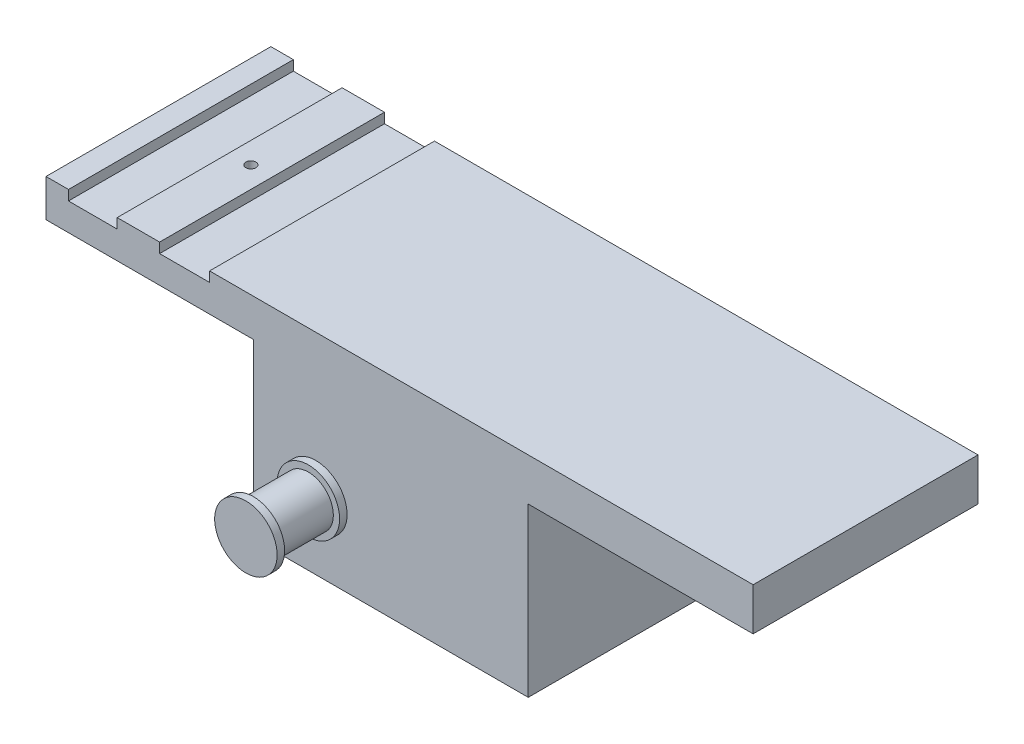
ISO-10303-21;
HEADER;
FILE_DESCRIPTION(('STEP AP214'),'2;1');
FILE_NAME('part.step','',(''),(''),'','','');
FILE_SCHEMA(('AUTOMOTIVE_DESIGN { 1 0 10303 214 1 1 1 1 }'));
ENDSEC;
DATA;
#1=APPLICATION_CONTEXT('core data for automotive mechanical design processes');
#2=APPLICATION_PROTOCOL_DEFINITION('international standard','automotive_design',2000,#1);
#3=PRODUCT_CONTEXT('',#1,'mechanical');
#4=PRODUCT('Part','Part','',(#3));
#5=PRODUCT_RELATED_PRODUCT_CATEGORY('part','',(#4));
#6=PRODUCT_DEFINITION_FORMATION('','',#4);
#7=PRODUCT_DEFINITION_CONTEXT('part definition',#1,'design');
#8=PRODUCT_DEFINITION('design','',#6,#7);
#9=PRODUCT_DEFINITION_SHAPE('','',#8);
#10=(LENGTH_UNIT() NAMED_UNIT(*) SI_UNIT(.MILLI.,.METRE.));
#11=(NAMED_UNIT(*) PLANE_ANGLE_UNIT() SI_UNIT($,.RADIAN.));
#12=(NAMED_UNIT(*) SI_UNIT($,.STERADIAN.) SOLID_ANGLE_UNIT());
#13=UNCERTAINTY_MEASURE_WITH_UNIT(LENGTH_MEASURE(1.E-05),#10,'distance_accuracy_value','');
#14=(GEOMETRIC_REPRESENTATION_CONTEXT(3) GLOBAL_UNCERTAINTY_ASSIGNED_CONTEXT((#13)) GLOBAL_UNIT_ASSIGNED_CONTEXT((#10,
#11,#12)) REPRESENTATION_CONTEXT('',''));
#15=CARTESIAN_POINT('',(0.,0.,0.));
#16=DIRECTION('',(0.,0.,1.));
#17=DIRECTION('',(1.,0.,0.));
#18=AXIS2_PLACEMENT_3D('',#15,#16,#17);
#19=CARTESIAN_POINT('',(-175.,-41.9467957222246,2.));
#20=DIRECTION('',(0.,0.,-1.));
#21=DIRECTION('',(-1.,0.,0.));
#22=AXIS2_PLACEMENT_3D('',#19,#20,#21);
#23=CYLINDRICAL_SURFACE('',#22,10.);
#24=CARTESIAN_POINT('',(-175.,-41.9467957222246,0.));
#25=DIRECTION('',(0.,0.,1.));
#26=DIRECTION('',(1.,0.,0.));
#27=AXIS2_PLACEMENT_3D('',#24,#25,#26);
#28=CIRCLE('',#27,10.);
#29=CARTESIAN_POINT('',(-165.,-41.9467957222246,0.));
#30=VERTEX_POINT('',#29);
#31=EDGE_CURVE('E365',#30,#30,#28,.F.);
#32=ORIENTED_EDGE('',*,*,#31,.T.);
#33=EDGE_LOOP('',(#32));
#34=FACE_BOUND('',#33,.T.);
#35=CARTESIAN_POINT('',(-175.,-41.9467957222246,-1.));
#36=DIRECTION('',(0.,0.,-1.));
#37=DIRECTION('',(-1.,0.,0.));
#38=AXIS2_PLACEMENT_3D('',#35,#36,#37);
#39=CIRCLE('',#38,10.);
#40=CARTESIAN_POINT('',(-185.,-41.9467957222246,-1.));
#41=VERTEX_POINT('',#40);
#42=EDGE_CURVE('E11',#41,#41,#39,.T.);
#43=ORIENTED_EDGE('',*,*,#42,.F.);
#44=EDGE_LOOP('',(#43));
#45=FACE_BOUND('',#44,.T.);
#46=ADVANCED_FACE('F38',(#34,#45),#23,.T.);
#47=CARTESIAN_POINT('',(0.,0.,90.));
#48=DIRECTION('',(-1.,0.,0.));
#49=DIRECTION('',(0.,0.,1.));
#50=AXIS2_PLACEMENT_3D('',#47,#48,#49);
#51=PLANE('',#50);
#52=DIRECTION('',(0.,0.,1.));
#53=VECTOR('',#52,1.);
#54=CARTESIAN_POINT('',(0.,-2.0467957222246,0.));
#55=LINE('',#54,#53);
#56=CARTESIAN_POINT('',(0.,-2.0467957222246,0.));
#57=VERTEX_POINT('',#56);
#58=CARTESIAN_POINT('',(0.,-2.0467957222246,90.));
#59=VERTEX_POINT('',#58);
#60=EDGE_CURVE('E245',#57,#59,#55,.T.);
#61=ORIENTED_EDGE('',*,*,#60,.F.);
#62=DIRECTION('',(0.,1.,0.));
#63=VECTOR('',#62,1.);
#64=CARTESIAN_POINT('',(0.,0.,0.));
#65=LINE('',#64,#63);
#66=CARTESIAN_POINT('',(0.,15.,0.));
#67=VERTEX_POINT('',#66);
#68=EDGE_CURVE('E314',#57,#67,#65,.T.);
#69=ORIENTED_EDGE('',*,*,#68,.T.);
#70=DIRECTION('',(0.,0.,-1.));
#71=VECTOR('',#70,1.);
#72=CARTESIAN_POINT('',(0.,15.,90.));
#73=LINE('',#72,#71);
#74=CARTESIAN_POINT('',(0.,15.,90.));
#75=VERTEX_POINT('',#74);
#76=EDGE_CURVE('E359',#75,#67,#73,.T.);
#77=ORIENTED_EDGE('',*,*,#76,.F.);
#78=DIRECTION('',(0.,1.,0.));
#79=VECTOR('',#78,1.);
#80=CARTESIAN_POINT('',(0.,0.,90.));
#81=LINE('',#80,#79);
#82=EDGE_CURVE('E288',#59,#75,#81,.T.);
#83=ORIENTED_EDGE('',*,*,#82,.F.);
#84=EDGE_LOOP('',(#61,#69,#77,#83));
#85=FACE_BOUND('',#84,.T.);
#86=ADVANCED_FACE('F407',(#85),#51,.F.);
#87=CARTESIAN_POINT('',(-283.,15.,90.));
#88=DIRECTION('',(1.,0.,0.));
#89=DIRECTION('',(0.,0.,-1.));
#90=AXIS2_PLACEMENT_3D('',#87,#88,#89);
#91=PLANE('',#90);
#92=DIRECTION('',(0.,-1.,0.));
#93=VECTOR('',#92,1.);
#94=CARTESIAN_POINT('',(-283.,15.,0.));
#95=LINE('',#94,#93);
#96=CARTESIAN_POINT('',(-283.,15.,0.));
#97=VERTEX_POINT('',#96);
#98=CARTESIAN_POINT('',(-283.,0.,0.));
#99=VERTEX_POINT('',#98);
#100=EDGE_CURVE('E280',#97,#99,#95,.T.);
#101=ORIENTED_EDGE('',*,*,#100,.T.);
#102=DIRECTION('',(0.,0.,-1.));
#103=VECTOR('',#102,1.);
#104=CARTESIAN_POINT('',(-283.,0.,90.));
#105=LINE('',#104,#103);
#106=CARTESIAN_POINT('',(-283.,0.,90.));
#107=VERTEX_POINT('',#106);
#108=EDGE_CURVE('E362',#107,#99,#105,.T.);
#109=ORIENTED_EDGE('',*,*,#108,.F.);
#110=DIRECTION('',(0.,-1.,0.));
#111=VECTOR('',#110,1.);
#112=CARTESIAN_POINT('',(-283.,15.,90.));
#113=LINE('',#112,#111);
#114=CARTESIAN_POINT('',(-283.,15.,90.));
#115=VERTEX_POINT('',#114);
#116=EDGE_CURVE('E281',#115,#107,#113,.T.);
#117=ORIENTED_EDGE('',*,*,#116,.F.);
#118=DIRECTION('',(0.,0.,-1.));
#119=VECTOR('',#118,1.);
#120=CARTESIAN_POINT('',(-283.,15.,90.));
#121=LINE('',#120,#119);
#122=EDGE_CURVE('E308',#115,#97,#121,.T.);
#123=ORIENTED_EDGE('',*,*,#122,.T.);
#124=EDGE_LOOP('',(#101,#109,#117,#123));
#125=FACE_BOUND('',#124,.T.);
#126=ADVANCED_FACE('F40',(#125),#91,.F.);
#127=CARTESIAN_POINT('',(-283.,0.,90.));
#128=DIRECTION('',(0.,1.,0.));
#129=DIRECTION('',(0.,0.,1.));
#130=AXIS2_PLACEMENT_3D('',#127,#128,#129);
#131=PLANE('',#130);
#132=CARTESIAN_POINT('',(-246.015,0.,45.));
#133=DIRECTION('',(0.,1.,0.));
#134=DIRECTION('',(0.,0.,1.));
#135=AXIS2_PLACEMENT_3D('',#132,#133,#134);
#136=CIRCLE('',#135,2.);
#137=CARTESIAN_POINT('',(-246.015,0.,47.));
#138=VERTEX_POINT('',#137);
#139=EDGE_CURVE('E277',#138,#138,#136,.T.);
#140=ORIENTED_EDGE('',*,*,#139,.T.);
#141=EDGE_LOOP('',(#140));
#142=FACE_BOUND('',#141,.T.);
#143=DIRECTION('',(1.,0.,0.));
#144=VECTOR('',#143,1.);
#145=CARTESIAN_POINT('',(-283.,0.,0.));
#146=LINE('',#145,#144);
#147=CARTESIAN_POINT('',(-200.,0.,0.));
#148=VERTEX_POINT('',#147);
#149=EDGE_CURVE('E311',#99,#148,#146,.T.);
#150=ORIENTED_EDGE('',*,*,#149,.T.);
#151=DIRECTION('',(0.,0.,1.));
#152=VECTOR('',#151,1.);
#153=CARTESIAN_POINT('',(-200.,0.,90.));
#154=LINE('',#153,#152);
#155=CARTESIAN_POINT('',(-200.,0.,90.));
#156=VERTEX_POINT('',#155);
#157=EDGE_CURVE('E268',#148,#156,#154,.T.);
#158=ORIENTED_EDGE('',*,*,#157,.T.);
#159=DIRECTION('',(1.,0.,0.));
#160=VECTOR('',#159,1.);
#161=CARTESIAN_POINT('',(-283.,0.,90.));
#162=LINE('',#161,#160);
#163=EDGE_CURVE('E284',#107,#156,#162,.T.);
#164=ORIENTED_EDGE('',*,*,#163,.F.);
#165=ORIENTED_EDGE('',*,*,#108,.T.);
#166=EDGE_LOOP('',(#150,#158,#164,#165));
#167=FACE_BOUND('',#166,.T.);
#168=ADVANCED_FACE('F737',(#142,#167),#131,.F.);
#169=CARTESIAN_POINT('',(0.,15.,90.));
#170=DIRECTION('',(0.,-1.,0.));
#171=DIRECTION('',(1.,0.,0.));
#172=AXIS2_PLACEMENT_3D('',#169,#170,#171);
#173=PLANE('',#172);
#174=DIRECTION('',(-1.,0.,0.));
#175=VECTOR('',#174,1.);
#176=CARTESIAN_POINT('',(0.,15.,0.));
#177=LINE('',#176,#175);
#178=CARTESIAN_POINT('',(-217.53,15.,0.));
#179=VERTEX_POINT('',#178);
#180=EDGE_CURVE('E316',#67,#179,#177,.T.);
#181=ORIENTED_EDGE('',*,*,#180,.T.);
#182=DIRECTION('',(0.,0.,-1.));
#183=VECTOR('',#182,1.);
#184=CARTESIAN_POINT('',(-217.53,15.,90.));
#185=LINE('',#184,#183);
#186=CARTESIAN_POINT('',(-217.53,15.,90.));
#187=VERTEX_POINT('',#186);
#188=EDGE_CURVE('E356',#187,#179,#185,.T.);
#189=ORIENTED_EDGE('',*,*,#188,.F.);
#190=DIRECTION('',(-1.,0.,0.));
#191=VECTOR('',#190,1.);
#192=CARTESIAN_POINT('',(0.,15.,90.));
#193=LINE('',#192,#191);
#194=EDGE_CURVE('E290',#75,#187,#193,.T.);
#195=ORIENTED_EDGE('',*,*,#194,.F.);
#196=ORIENTED_EDGE('',*,*,#76,.T.);
#197=EDGE_LOOP('',(#181,#189,#195,#196));
#198=FACE_BOUND('',#197,.T.);
#199=ADVANCED_FACE('F729',(#198),#173,.F.);
#200=CARTESIAN_POINT('',(-217.53,15.,90.));
#201=DIRECTION('',(1.,0.,0.));
#202=DIRECTION('',(0.,0.,-1.));
#203=AXIS2_PLACEMENT_3D('',#200,#201,#202);
#204=PLANE('',#203);
#205=DIRECTION('',(0.,-1.,0.));
#206=VECTOR('',#205,1.);
#207=CARTESIAN_POINT('',(-217.53,15.,0.));
#208=LINE('',#207,#206);
#209=CARTESIAN_POINT('',(-217.53,11.,0.));
#210=VERTEX_POINT('',#209);
#211=EDGE_CURVE('E318',#179,#210,#208,.T.);
#212=ORIENTED_EDGE('',*,*,#211,.T.);
#213=DIRECTION('',(0.,0.,-1.));
#214=VECTOR('',#213,1.);
#215=CARTESIAN_POINT('',(-217.53,11.,90.));
#216=LINE('',#215,#214);
#217=CARTESIAN_POINT('',(-217.53,11.,90.));
#218=VERTEX_POINT('',#217);
#219=EDGE_CURVE('E353',#218,#210,#216,.T.);
#220=ORIENTED_EDGE('',*,*,#219,.F.);
#221=DIRECTION('',(0.,-1.,0.));
#222=VECTOR('',#221,1.);
#223=CARTESIAN_POINT('',(-217.53,15.,90.));
#224=LINE('',#223,#222);
#225=EDGE_CURVE('E292',#187,#218,#224,.T.);
#226=ORIENTED_EDGE('',*,*,#225,.F.);
#227=ORIENTED_EDGE('',*,*,#188,.T.);
#228=EDGE_LOOP('',(#212,#220,#226,#227));
#229=FACE_BOUND('',#228,.T.);
#230=ADVANCED_FACE('F721',(#229),#204,.F.);
#231=CARTESIAN_POINT('',(-217.53,11.,90.));
#232=DIRECTION('',(0.,-1.,0.));
#233=DIRECTION('',(1.,0.,0.));
#234=AXIS2_PLACEMENT_3D('',#231,#232,#233);
#235=PLANE('',#234);
#236=DIRECTION('',(-1.,0.,0.));
#237=VECTOR('',#236,1.);
#238=CARTESIAN_POINT('',(-217.53,11.,0.));
#239=LINE('',#238,#237);
#240=CARTESIAN_POINT('',(-237.53,11.,0.));
#241=VERTEX_POINT('',#240);
#242=EDGE_CURVE('E320',#210,#241,#239,.T.);
#243=ORIENTED_EDGE('',*,*,#242,.T.);
#244=DIRECTION('',(0.,0.,-1.));
#245=VECTOR('',#244,1.);
#246=CARTESIAN_POINT('',(-237.53,11.,90.));
#247=LINE('',#246,#245);
#248=CARTESIAN_POINT('',(-237.53,11.,90.));
#249=VERTEX_POINT('',#248);
#250=EDGE_CURVE('E350',#249,#241,#247,.T.);
#251=ORIENTED_EDGE('',*,*,#250,.F.);
#252=DIRECTION('',(-1.,0.,0.));
#253=VECTOR('',#252,1.);
#254=CARTESIAN_POINT('',(-217.53,11.,90.));
#255=LINE('',#254,#253);
#256=EDGE_CURVE('E294',#218,#249,#255,.T.);
#257=ORIENTED_EDGE('',*,*,#256,.F.);
#258=ORIENTED_EDGE('',*,*,#219,.T.);
#259=EDGE_LOOP('',(#243,#251,#257,#258));
#260=FACE_BOUND('',#259,.T.);
#261=ADVANCED_FACE('F713',(#260),#235,.F.);
#262=CARTESIAN_POINT('',(-237.53,11.,90.));
#263=DIRECTION('',(-1.,0.,0.));
#264=DIRECTION('',(0.,0.,1.));
#265=AXIS2_PLACEMENT_3D('',#262,#263,#264);
#266=PLANE('',#265);
#267=DIRECTION('',(0.,1.,0.));
#268=VECTOR('',#267,1.);
#269=CARTESIAN_POINT('',(-237.53,11.,0.));
#270=LINE('',#269,#268);
#271=CARTESIAN_POINT('',(-237.53,15.,0.));
#272=VERTEX_POINT('',#271);
#273=EDGE_CURVE('E322',#241,#272,#270,.T.);
#274=ORIENTED_EDGE('',*,*,#273,.T.);
#275=DIRECTION('',(0.,0.,-1.));
#276=VECTOR('',#275,1.);
#277=CARTESIAN_POINT('',(-237.53,15.,90.));
#278=LINE('',#277,#276);
#279=CARTESIAN_POINT('',(-237.53,15.,90.));
#280=VERTEX_POINT('',#279);
#281=EDGE_CURVE('E347',#280,#272,#278,.T.);
#282=ORIENTED_EDGE('',*,*,#281,.F.);
#283=DIRECTION('',(0.,1.,0.));
#284=VECTOR('',#283,1.);
#285=CARTESIAN_POINT('',(-237.53,11.,90.));
#286=LINE('',#285,#284);
#287=EDGE_CURVE('E296',#249,#280,#286,.T.);
#288=ORIENTED_EDGE('',*,*,#287,.F.);
#289=ORIENTED_EDGE('',*,*,#250,.T.);
#290=EDGE_LOOP('',(#274,#282,#288,#289));
#291=FACE_BOUND('',#290,.T.);
#292=ADVANCED_FACE('F706',(#291),#266,.F.);
#293=CARTESIAN_POINT('',(-237.53,15.,90.));
#294=DIRECTION('',(0.,-1.,0.));
#295=DIRECTION('',(1.,0.,0.));
#296=AXIS2_PLACEMENT_3D('',#293,#294,#295);
#297=PLANE('',#296);
#298=CARTESIAN_POINT('',(-246.015,15.0000000000001,45.));
#299=DIRECTION('',(0.,1.,0.));
#300=DIRECTION('',(-1.,0.,0.));
#301=AXIS2_PLACEMENT_3D('',#298,#299,#300);
#302=CIRCLE('',#301,2.);
#303=CARTESIAN_POINT('',(-248.015,15.0000000000001,45.));
#304=VERTEX_POINT('',#303);
#305=EDGE_CURVE('E274',#304,#304,#302,.T.);
#306=ORIENTED_EDGE('',*,*,#305,.F.);
#307=EDGE_LOOP('',(#306));
#308=FACE_BOUND('',#307,.T.);
#309=DIRECTION('',(-1.,0.,0.));
#310=VECTOR('',#309,1.);
#311=CARTESIAN_POINT('',(-237.53,15.,0.));
#312=LINE('',#311,#310);
#313=CARTESIAN_POINT('',(-254.5,15.,0.));
#314=VERTEX_POINT('',#313);
#315=EDGE_CURVE('E324',#272,#314,#312,.T.);
#316=ORIENTED_EDGE('',*,*,#315,.T.);
#317=DIRECTION('',(0.,0.,-1.));
#318=VECTOR('',#317,1.);
#319=CARTESIAN_POINT('',(-254.5,15.,90.));
#320=LINE('',#319,#318);
#321=CARTESIAN_POINT('',(-254.5,15.,90.));
#322=VERTEX_POINT('',#321);
#323=EDGE_CURVE('E344',#322,#314,#320,.T.);
#324=ORIENTED_EDGE('',*,*,#323,.F.);
#325=DIRECTION('',(-1.,0.,0.));
#326=VECTOR('',#325,1.);
#327=CARTESIAN_POINT('',(-237.53,15.,90.));
#328=LINE('',#327,#326);
#329=EDGE_CURVE('E298',#280,#322,#328,.T.);
#330=ORIENTED_EDGE('',*,*,#329,.F.);
#331=ORIENTED_EDGE('',*,*,#281,.T.);
#332=EDGE_LOOP('',(#316,#324,#330,#331));
#333=FACE_BOUND('',#332,.T.);
#334=ADVANCED_FACE('F698',(#308,#333),#297,.F.);
#335=CARTESIAN_POINT('',(-254.5,15.,90.));
#336=DIRECTION('',(1.,0.,0.));
#337=DIRECTION('',(0.,0.,-1.));
#338=AXIS2_PLACEMENT_3D('',#335,#336,#337);
#339=PLANE('',#338);
#340=DIRECTION('',(0.,-1.,0.));
#341=VECTOR('',#340,1.);
#342=CARTESIAN_POINT('',(-254.5,15.,0.));
#343=LINE('',#342,#341);
#344=CARTESIAN_POINT('',(-254.5,11.,0.));
#345=VERTEX_POINT('',#344);
#346=EDGE_CURVE('E326',#314,#345,#343,.T.);
#347=ORIENTED_EDGE('',*,*,#346,.T.);
#348=DIRECTION('',(0.,0.,-1.));
#349=VECTOR('',#348,1.);
#350=CARTESIAN_POINT('',(-254.5,11.,90.));
#351=LINE('',#350,#349);
#352=CARTESIAN_POINT('',(-254.5,11.,90.));
#353=VERTEX_POINT('',#352);
#354=EDGE_CURVE('E341',#353,#345,#351,.T.);
#355=ORIENTED_EDGE('',*,*,#354,.F.);
#356=DIRECTION('',(0.,-1.,0.));
#357=VECTOR('',#356,1.);
#358=CARTESIAN_POINT('',(-254.5,15.,90.));
#359=LINE('',#358,#357);
#360=EDGE_CURVE('E300',#322,#353,#359,.T.);
#361=ORIENTED_EDGE('',*,*,#360,.F.);
#362=ORIENTED_EDGE('',*,*,#323,.T.);
#363=EDGE_LOOP('',(#347,#355,#361,#362));
#364=FACE_BOUND('',#363,.T.);
#365=ADVANCED_FACE('F690',(#364),#339,.F.);
#366=CARTESIAN_POINT('',(-254.5,11.,90.));
#367=DIRECTION('',(0.,-1.,0.));
#368=DIRECTION('',(1.,0.,0.));
#369=AXIS2_PLACEMENT_3D('',#366,#367,#368);
#370=PLANE('',#369);
#371=DIRECTION('',(-1.,0.,0.));
#372=VECTOR('',#371,1.);
#373=CARTESIAN_POINT('',(-254.5,11.,0.));
#374=LINE('',#373,#372);
#375=CARTESIAN_POINT('',(-274.,11.,0.));
#376=VERTEX_POINT('',#375);
#377=EDGE_CURVE('E328',#345,#376,#374,.T.);
#378=ORIENTED_EDGE('',*,*,#377,.T.);
#379=DIRECTION('',(0.,0.,-1.));
#380=VECTOR('',#379,1.);
#381=CARTESIAN_POINT('',(-274.,11.,90.));
#382=LINE('',#381,#380);
#383=CARTESIAN_POINT('',(-274.,11.,90.));
#384=VERTEX_POINT('',#383);
#385=EDGE_CURVE('E338',#384,#376,#382,.T.);
#386=ORIENTED_EDGE('',*,*,#385,.F.);
#387=DIRECTION('',(-1.,0.,0.));
#388=VECTOR('',#387,1.);
#389=CARTESIAN_POINT('',(-254.5,11.,90.));
#390=LINE('',#389,#388);
#391=EDGE_CURVE('E302',#353,#384,#390,.T.);
#392=ORIENTED_EDGE('',*,*,#391,.F.);
#393=ORIENTED_EDGE('',*,*,#354,.T.);
#394=EDGE_LOOP('',(#378,#386,#392,#393));
#395=FACE_BOUND('',#394,.T.);
#396=ADVANCED_FACE('F682',(#395),#370,.F.);
#397=CARTESIAN_POINT('',(-274.,11.,90.));
#398=DIRECTION('',(-1.,0.,0.));
#399=DIRECTION('',(0.,0.,1.));
#400=AXIS2_PLACEMENT_3D('',#397,#398,#399);
#401=PLANE('',#400);
#402=DIRECTION('',(0.,1.,0.));
#403=VECTOR('',#402,1.);
#404=CARTESIAN_POINT('',(-274.,11.,0.));
#405=LINE('',#404,#403);
#406=CARTESIAN_POINT('',(-274.,15.,0.));
#407=VERTEX_POINT('',#406);
#408=EDGE_CURVE('E330',#376,#407,#405,.T.);
#409=ORIENTED_EDGE('',*,*,#408,.T.);
#410=DIRECTION('',(0.,0.,-1.));
#411=VECTOR('',#410,1.);
#412=CARTESIAN_POINT('',(-274.,15.,90.));
#413=LINE('',#412,#411);
#414=CARTESIAN_POINT('',(-274.,15.,90.));
#415=VERTEX_POINT('',#414);
#416=EDGE_CURVE('E335',#415,#407,#413,.T.);
#417=ORIENTED_EDGE('',*,*,#416,.F.);
#418=DIRECTION('',(0.,1.,0.));
#419=VECTOR('',#418,1.);
#420=CARTESIAN_POINT('',(-274.,11.,90.));
#421=LINE('',#420,#419);
#422=EDGE_CURVE('E304',#384,#415,#421,.T.);
#423=ORIENTED_EDGE('',*,*,#422,.F.);
#424=ORIENTED_EDGE('',*,*,#385,.T.);
#425=EDGE_LOOP('',(#409,#417,#423,#424));
#426=FACE_BOUND('',#425,.T.);
#427=ADVANCED_FACE('F674',(#426),#401,.F.);
#428=CARTESIAN_POINT('',(-274.,15.,90.));
#429=DIRECTION('',(0.,-1.,0.));
#430=DIRECTION('',(1.,0.,0.));
#431=AXIS2_PLACEMENT_3D('',#428,#429,#430);
#432=PLANE('',#431);
#433=DIRECTION('',(-1.,0.,0.));
#434=VECTOR('',#433,1.);
#435=CARTESIAN_POINT('',(-274.,15.,0.));
#436=LINE('',#435,#434);
#437=EDGE_CURVE('E285',#407,#97,#436,.T.);
#438=ORIENTED_EDGE('',*,*,#437,.T.);
#439=ORIENTED_EDGE('',*,*,#122,.F.);
#440=DIRECTION('',(-1.,0.,0.));
#441=VECTOR('',#440,1.);
#442=CARTESIAN_POINT('',(-274.,15.,90.));
#443=LINE('',#442,#441);
#444=EDGE_CURVE('E306',#415,#115,#443,.T.);
#445=ORIENTED_EDGE('',*,*,#444,.F.);
#446=ORIENTED_EDGE('',*,*,#416,.T.);
#447=EDGE_LOOP('',(#438,#439,#445,#446));
#448=FACE_BOUND('',#447,.T.);
#449=ADVANCED_FACE('F666',(#448),#432,.F.);
#450=CARTESIAN_POINT('',(0.,0.,90.));
#451=DIRECTION('',(0.,0.,1.));
#452=DIRECTION('',(1.,0.,0.));
#453=AXIS2_PLACEMENT_3D('',#450,#451,#452);
#454=PLANE('',#453);
#455=CARTESIAN_POINT('',(-175.,-41.9467957222246,90.));
#456=DIRECTION('',(0.,0.,1.));
#457=DIRECTION('',(1.,0.,0.));
#458=AXIS2_PLACEMENT_3D('',#455,#456,#457);
#459=CIRCLE('',#458,12.5);
#460=CARTESIAN_POINT('',(-162.5,-41.9467957222246,90.));
#461=VERTEX_POINT('',#460);
#462=EDGE_CURVE('E228',#461,#461,#459,.T.);
#463=ORIENTED_EDGE('',*,*,#462,.F.);
#464=EDGE_LOOP('',(#463));
#465=FACE_BOUND('',#464,.T.);
#466=DIRECTION('',(-1.,0.,0.));
#467=VECTOR('',#466,1.);
#468=CARTESIAN_POINT('',(-191.923302065057,-69.0467957222246,90.));
#469=LINE('',#468,#467);
#470=CARTESIAN_POINT('',(-90.,-69.0467957222246,90.));
#471=VERTEX_POINT('',#470);
#472=CARTESIAN_POINT('',(-200.,-69.0467957222246,90.));
#473=VERTEX_POINT('',#472);
#474=EDGE_CURVE('E62',#471,#473,#469,.T.);
#475=ORIENTED_EDGE('',*,*,#474,.F.);
#476=DIRECTION('',(0.,-1.,0.));
#477=VECTOR('',#476,1.);
#478=CARTESIAN_POINT('',(-90.,-2.0467957222246,90.));
#479=LINE('',#478,#477);
#480=CARTESIAN_POINT('',(-90.,-2.0467957222246,90.));
#481=VERTEX_POINT('',#480);
#482=EDGE_CURVE('E253',#481,#471,#479,.T.);
#483=ORIENTED_EDGE('',*,*,#482,.F.);
#484=DIRECTION('',(-1.,0.,0.));
#485=VECTOR('',#484,1.);
#486=CARTESIAN_POINT('',(0.,-2.0467957222246,90.));
#487=LINE('',#486,#485);
#488=EDGE_CURVE('E248',#59,#481,#487,.T.);
#489=ORIENTED_EDGE('',*,*,#488,.F.);
#490=ORIENTED_EDGE('',*,*,#82,.T.);
#491=ORIENTED_EDGE('',*,*,#194,.T.);
#492=ORIENTED_EDGE('',*,*,#225,.T.);
#493=ORIENTED_EDGE('',*,*,#256,.T.);
#494=ORIENTED_EDGE('',*,*,#287,.T.);
#495=ORIENTED_EDGE('',*,*,#329,.T.);
#496=ORIENTED_EDGE('',*,*,#360,.T.);
#497=ORIENTED_EDGE('',*,*,#391,.T.);
#498=ORIENTED_EDGE('',*,*,#422,.T.);
#499=ORIENTED_EDGE('',*,*,#444,.T.);
#500=ORIENTED_EDGE('',*,*,#116,.T.);
#501=ORIENTED_EDGE('',*,*,#163,.T.);
#502=DIRECTION('',(0.,1.,0.));
#503=VECTOR('',#502,1.);
#504=CARTESIAN_POINT('',(-200.,-61.6,90.));
#505=LINE('',#504,#503);
#506=EDGE_CURVE('E266',#473,#156,#505,.T.);
#507=ORIENTED_EDGE('',*,*,#506,.F.);
#508=EDGE_LOOP('',(#475,#483,#489,#490,#491,#492,#493,#494,#495,#496,#497,#498,#499,#500,#501,#507));
#509=FACE_BOUND('',#508,.T.);
#510=ADVANCED_FACE('F659',(#465,#509),#454,.T.);
#511=CARTESIAN_POINT('',(0.,0.,0.));
#512=DIRECTION('',(0.,0.,1.));
#513=DIRECTION('',(1.,0.,0.));
#514=AXIS2_PLACEMENT_3D('',#511,#512,#513);
#515=PLANE('',#514);
#516=ORIENTED_EDGE('',*,*,#31,.F.);
#517=EDGE_LOOP('',(#516));
#518=FACE_BOUND('',#517,.T.);
#519=DIRECTION('',(0.,-1.,0.));
#520=VECTOR('',#519,1.);
#521=CARTESIAN_POINT('',(-90.,-2.0467957222246,0.));
#522=LINE('',#521,#520);
#523=CARTESIAN_POINT('',(-90.,-2.0467957222246,0.));
#524=VERTEX_POINT('',#523);
#525=CARTESIAN_POINT('',(-90.,-69.0467957222246,0.));
#526=VERTEX_POINT('',#525);
#527=EDGE_CURVE('E256',#524,#526,#522,.T.);
#528=ORIENTED_EDGE('',*,*,#527,.T.);
#529=DIRECTION('',(-1.,0.,0.));
#530=VECTOR('',#529,1.);
#531=CARTESIAN_POINT('',(-191.923302065057,-69.0467957222246,0.));
#532=LINE('',#531,#530);
#533=CARTESIAN_POINT('',(-200.,-69.0467957222246,0.));
#534=VERTEX_POINT('',#533);
#535=EDGE_CURVE('E259',#526,#534,#532,.T.);
#536=ORIENTED_EDGE('',*,*,#535,.T.);
#537=DIRECTION('',(0.,1.,0.));
#538=VECTOR('',#537,1.);
#539=CARTESIAN_POINT('',(-200.,-61.6,0.));
#540=LINE('',#539,#538);
#541=EDGE_CURVE('E261',#534,#148,#540,.T.);
#542=ORIENTED_EDGE('',*,*,#541,.T.);
#543=ORIENTED_EDGE('',*,*,#149,.F.);
#544=ORIENTED_EDGE('',*,*,#100,.F.);
#545=ORIENTED_EDGE('',*,*,#437,.F.);
#546=ORIENTED_EDGE('',*,*,#408,.F.);
#547=ORIENTED_EDGE('',*,*,#377,.F.);
#548=ORIENTED_EDGE('',*,*,#346,.F.);
#549=ORIENTED_EDGE('',*,*,#315,.F.);
#550=ORIENTED_EDGE('',*,*,#273,.F.);
#551=ORIENTED_EDGE('',*,*,#242,.F.);
#552=ORIENTED_EDGE('',*,*,#211,.F.);
#553=ORIENTED_EDGE('',*,*,#180,.F.);
#554=ORIENTED_EDGE('',*,*,#68,.F.);
#555=DIRECTION('',(1.,0.,0.));
#556=VECTOR('',#555,1.);
#557=CARTESIAN_POINT('',(-8.07669793494292,-2.0467957222246,0.));
#558=LINE('',#557,#556);
#559=EDGE_CURVE('E243',#524,#57,#558,.T.);
#560=ORIENTED_EDGE('',*,*,#559,.F.);
#561=EDGE_LOOP('',(#528,#536,#542,#543,#544,#545,#546,#547,#548,#549,#550,#551,#552,#553,#554,#560));
#562=FACE_BOUND('',#561,.T.);
#563=ADVANCED_FACE('F651',(#518,#562),#515,.F.);
#564=CARTESIAN_POINT('',(-246.015,-10.9999999999999,45.));
#565=DIRECTION('',(0.,1.,0.));
#566=DIRECTION('',(-1.,0.,0.));
#567=AXIS2_PLACEMENT_3D('',#564,#565,#566);
#568=CYLINDRICAL_SURFACE('',#567,2.);
#569=ORIENTED_EDGE('',*,*,#305,.T.);
#570=EDGE_LOOP('',(#569));
#571=FACE_BOUND('',#570,.T.);
#572=ORIENTED_EDGE('',*,*,#139,.F.);
#573=EDGE_LOOP('',(#572));
#574=FACE_BOUND('',#573,.T.);
#575=ADVANCED_FACE('F642',(#571,#574),#568,.F.);
#576=CARTESIAN_POINT('',(-200.,-61.6,304.148107475504));
#577=DIRECTION('',(-1.,0.,0.));
#578=DIRECTION('',(0.,-1.,0.));
#579=AXIS2_PLACEMENT_3D('',#576,#577,#578);
#580=PLANE('',#579);
#581=ORIENTED_EDGE('',*,*,#157,.F.);
#582=ORIENTED_EDGE('',*,*,#541,.F.);
#583=DIRECTION('',(0.,0.,-1.));
#584=VECTOR('',#583,1.);
#585=CARTESIAN_POINT('',(-200.,-69.0467957222246,304.148107475504));
#586=LINE('',#585,#584);
#587=EDGE_CURVE('E269',#473,#534,#586,.T.);
#588=ORIENTED_EDGE('',*,*,#587,.F.);
#589=ORIENTED_EDGE('',*,*,#506,.T.);
#590=EDGE_LOOP('',(#581,#582,#588,#589));
#591=FACE_BOUND('',#590,.T.);
#592=ADVANCED_FACE('F633',(#591),#580,.T.);
#593=CARTESIAN_POINT('',(-71.9233020650571,-69.0467957222246,304.148107475504));
#594=DIRECTION('',(0.,-1.,0.));
#595=DIRECTION('',(0.,0.,-1.));
#596=AXIS2_PLACEMENT_3D('',#593,#594,#595);
#597=PLANE('',#596);
#598=DIRECTION('',(0.,0.,-1.));
#599=VECTOR('',#598,1.);
#600=CARTESIAN_POINT('',(-90.,-69.0467957222246,90.));
#601=LINE('',#600,#599);
#602=EDGE_CURVE('E246',#471,#526,#601,.T.);
#603=ORIENTED_EDGE('',*,*,#602,.F.);
#604=ORIENTED_EDGE('',*,*,#474,.T.);
#605=ORIENTED_EDGE('',*,*,#587,.T.);
#606=ORIENTED_EDGE('',*,*,#535,.F.);
#607=EDGE_LOOP('',(#603,#604,#605,#606));
#608=FACE_BOUND('',#607,.T.);
#609=ADVANCED_FACE('F625',(#608),#597,.T.);
#610=CARTESIAN_POINT('',(-90.,-2.0467957222246,90.));
#611=DIRECTION('',(-1.,0.,0.));
#612=DIRECTION('',(0.,0.,1.));
#613=AXIS2_PLACEMENT_3D('',#610,#611,#612);
#614=PLANE('',#613);
#615=ORIENTED_EDGE('',*,*,#602,.T.);
#616=ORIENTED_EDGE('',*,*,#527,.F.);
#617=DIRECTION('',(0.,0.,-1.));
#618=VECTOR('',#617,1.);
#619=CARTESIAN_POINT('',(-90.,-2.0467957222246,90.));
#620=LINE('',#619,#618);
#621=EDGE_CURVE('E250',#481,#524,#620,.T.);
#622=ORIENTED_EDGE('',*,*,#621,.F.);
#623=ORIENTED_EDGE('',*,*,#482,.T.);
#624=EDGE_LOOP('',(#615,#616,#622,#623));
#625=FACE_BOUND('',#624,.T.);
#626=ADVANCED_FACE('F611',(#625),#614,.F.);
#627=CARTESIAN_POINT('',(0.,-2.0467957222246,0.));
#628=DIRECTION('',(0.,-1.,0.));
#629=DIRECTION('',(0.,0.,-1.));
#630=AXIS2_PLACEMENT_3D('',#627,#628,#629);
#631=PLANE('',#630);
#632=DIRECTION('',(0.,0.,1.));
#633=VECTOR('',#632,1.);
#634=CARTESIAN_POINT('',(-20.,-2.0467957222246,62.));
#635=LINE('',#634,#633);
#636=CARTESIAN_POINT('',(-20.,-2.0467957222246,28.));
#637=VERTEX_POINT('',#636);
#638=CARTESIAN_POINT('',(-20.,-2.0467957222246,62.));
#639=VERTEX_POINT('',#638);
#640=EDGE_CURVE('E54',#637,#639,#635,.T.);
#641=ORIENTED_EDGE('',*,*,#640,.F.);
#642=DIRECTION('',(1.,0.,0.));
#643=VECTOR('',#642,1.);
#644=CARTESIAN_POINT('',(-54.,-2.0467957222246,28.));
#645=LINE('',#644,#643);
#646=CARTESIAN_POINT('',(-54.,-2.0467957222246,28.));
#647=VERTEX_POINT('',#646);
#648=EDGE_CURVE('E197',#647,#637,#645,.T.);
#649=ORIENTED_EDGE('',*,*,#648,.F.);
#650=DIRECTION('',(0.,0.,-1.));
#651=VECTOR('',#650,1.);
#652=CARTESIAN_POINT('',(-54.,-2.0467957222246,62.));
#653=LINE('',#652,#651);
#654=CARTESIAN_POINT('',(-54.,-2.0467957222246,62.));
#655=VERTEX_POINT('',#654);
#656=EDGE_CURVE('E200',#655,#647,#653,.T.);
#657=ORIENTED_EDGE('',*,*,#656,.F.);
#658=DIRECTION('',(-1.,0.,0.));
#659=VECTOR('',#658,1.);
#660=CARTESIAN_POINT('',(-54.,-2.0467957222246,62.));
#661=LINE('',#660,#659);
#662=EDGE_CURVE('E209',#639,#655,#661,.T.);
#663=ORIENTED_EDGE('',*,*,#662,.F.);
#664=EDGE_LOOP('',(#641,#649,#657,#663));
#665=FACE_BOUND('',#664,.T.);
#666=ORIENTED_EDGE('',*,*,#559,.T.);
#667=ORIENTED_EDGE('',*,*,#60,.T.);
#668=ORIENTED_EDGE('',*,*,#488,.T.);
#669=ORIENTED_EDGE('',*,*,#621,.T.);
#670=EDGE_LOOP('',(#666,#667,#668,#669));
#671=FACE_BOUND('',#670,.T.);
#672=ADVANCED_FACE('F453',(#665,#671),#631,.T.);
#673=CARTESIAN_POINT('',(-175.,-41.9467957222246,93.));
#674=DIRECTION('',(0.,0.,-1.));
#675=DIRECTION('',(-1.,0.,0.));
#676=AXIS2_PLACEMENT_3D('',#673,#674,#675);
#677=CYLINDRICAL_SURFACE('',#676,12.5);
#678=CARTESIAN_POINT('',(-175.,-41.9467957222246,93.));
#679=DIRECTION('',(0.,0.,1.));
#680=DIRECTION('',(1.,0.,0.));
#681=AXIS2_PLACEMENT_3D('',#678,#679,#680);
#682=CIRCLE('',#681,12.5);
#683=CARTESIAN_POINT('',(-162.5,-41.9467957222246,93.));
#684=VERTEX_POINT('',#683);
#685=EDGE_CURVE('E224',#684,#684,#682,.T.);
#686=ORIENTED_EDGE('',*,*,#685,.F.);
#687=EDGE_LOOP('',(#686));
#688=FACE_BOUND('',#687,.T.);
#689=ORIENTED_EDGE('',*,*,#462,.T.);
#690=EDGE_LOOP('',(#689));
#691=FACE_BOUND('',#690,.T.);
#692=ADVANCED_FACE('F404',(#688,#691),#677,.T.);
#693=CARTESIAN_POINT('',(-175.,-41.9467957222246,93.));
#694=DIRECTION('',(0.,0.,1.));
#695=DIRECTION('',(1.,0.,0.));
#696=AXIS2_PLACEMENT_3D('',#693,#694,#695);
#697=PLANE('',#696);
#698=CARTESIAN_POINT('',(-175.,-41.9467957222246,93.));
#699=DIRECTION('',(0.,0.,1.));
#700=DIRECTION('',(1.,0.,0.));
#701=AXIS2_PLACEMENT_3D('',#698,#699,#700);
#702=CIRCLE('',#701,10.);
#703=CARTESIAN_POINT('',(-165.,-41.9467957222246,93.));
#704=VERTEX_POINT('',#703);
#705=EDGE_CURVE('E47',#704,#704,#702,.F.);
#706=ORIENTED_EDGE('',*,*,#705,.T.);
#707=EDGE_LOOP('',(#706));
#708=FACE_BOUND('',#707,.T.);
#709=ORIENTED_EDGE('',*,*,#685,.T.);
#710=EDGE_LOOP('',(#709));
#711=FACE_BOUND('',#710,.T.);
#712=ADVANCED_FACE('F376',(#708,#711),#697,.T.);
#713=CARTESIAN_POINT('',(-175.,-41.9467957222246,118.));
#714=DIRECTION('',(0.,0.,1.));
#715=DIRECTION('',(1.,0.,0.));
#716=AXIS2_PLACEMENT_3D('',#713,#714,#715);
#717=PLANE('',#716);
#718=CARTESIAN_POINT('',(-175.,-41.9467957222246,118.));
#719=DIRECTION('',(0.,0.,1.));
#720=DIRECTION('',(1.,0.,0.));
#721=AXIS2_PLACEMENT_3D('',#718,#719,#720);
#722=CIRCLE('',#721,12.5);
#723=CARTESIAN_POINT('',(-162.5,-41.9467957222246,118.));
#724=VERTEX_POINT('',#723);
#725=EDGE_CURVE('E234',#724,#724,#722,.T.);
#726=ORIENTED_EDGE('',*,*,#725,.T.);
#727=EDGE_LOOP('',(#726));
#728=FACE_BOUND('',#727,.T.);
#729=ADVANCED_FACE('F395',(#728),#717,.T.);
#730=CARTESIAN_POINT('',(-175.,-41.9467957222246,115.));
#731=DIRECTION('',(0.,0.,1.));
#732=DIRECTION('',(1.,0.,0.));
#733=AXIS2_PLACEMENT_3D('',#730,#731,#732);
#734=CYLINDRICAL_SURFACE('',#733,12.5);
#735=CARTESIAN_POINT('',(-175.,-41.9467957222246,115.));
#736=DIRECTION('',(0.,0.,1.));
#737=DIRECTION('',(1.,0.,0.));
#738=AXIS2_PLACEMENT_3D('',#735,#736,#737);
#739=CIRCLE('',#738,12.5);
#740=CARTESIAN_POINT('',(-162.5,-41.9467957222246,115.));
#741=VERTEX_POINT('',#740);
#742=EDGE_CURVE('E237',#741,#741,#739,.T.);
#743=ORIENTED_EDGE('',*,*,#742,.T.);
#744=EDGE_LOOP('',(#743));
#745=FACE_BOUND('',#744,.T.);
#746=ORIENTED_EDGE('',*,*,#725,.F.);
#747=EDGE_LOOP('',(#746));
#748=FACE_BOUND('',#747,.T.);
#749=ADVANCED_FACE('F389',(#745,#748),#734,.T.);
#750=CARTESIAN_POINT('',(-175.,-41.9467957222246,115.));
#751=DIRECTION('',(0.,0.,1.));
#752=DIRECTION('',(1.,0.,0.));
#753=AXIS2_PLACEMENT_3D('',#750,#751,#752);
#754=PLANE('',#753);
#755=CARTESIAN_POINT('',(-175.,-41.9467957222246,115.));
#756=DIRECTION('',(0.,0.,1.));
#757=DIRECTION('',(1.,0.,0.));
#758=AXIS2_PLACEMENT_3D('',#755,#756,#757);
#759=CIRCLE('',#758,10.);
#760=CARTESIAN_POINT('',(-165.,-41.9467957222246,115.));
#761=VERTEX_POINT('',#760);
#762=EDGE_CURVE('E240',#761,#761,#759,.F.);
#763=ORIENTED_EDGE('',*,*,#762,.F.);
#764=EDGE_LOOP('',(#763));
#765=FACE_BOUND('',#764,.T.);
#766=ORIENTED_EDGE('',*,*,#742,.F.);
#767=EDGE_LOOP('',(#766));
#768=FACE_BOUND('',#767,.T.);
#769=ADVANCED_FACE('F383',(#765,#768),#754,.F.);
#770=CARTESIAN_POINT('',(-175.,-41.9467957222246,87.));
#771=DIRECTION('',(0.,0.,1.));
#772=DIRECTION('',(1.,0.,0.));
#773=AXIS2_PLACEMENT_3D('',#770,#771,#772);
#774=CYLINDRICAL_SURFACE('',#773,10.);
#775=ORIENTED_EDGE('',*,*,#705,.F.);
#776=EDGE_LOOP('',(#775));
#777=FACE_BOUND('',#776,.T.);
#778=ORIENTED_EDGE('',*,*,#762,.T.);
#779=EDGE_LOOP('',(#778));
#780=FACE_BOUND('',#779,.T.);
#781=ADVANCED_FACE('F379',(#777,#780),#774,.T.);
#782=CARTESIAN_POINT('',(-175.,-41.9467957222246,-4.));
#783=DIRECTION('',(0.,0.,1.));
#784=DIRECTION('',(1.,0.,0.));
#785=AXIS2_PLACEMENT_3D('',#782,#783,#784);
#786=CYLINDRICAL_SURFACE('',#785,12.5);
#787=CARTESIAN_POINT('',(-175.,-41.9467957222246,-4.));
#788=DIRECTION('',(0.,0.,1.));
#789=DIRECTION('',(1.,0.,0.));
#790=AXIS2_PLACEMENT_3D('',#787,#788,#789);
#791=CIRCLE('',#790,12.5);
#792=CARTESIAN_POINT('',(-162.5,-41.9467957222246,-4.));
#793=VERTEX_POINT('',#792);
#794=EDGE_CURVE('E219',#793,#793,#791,.T.);
#795=ORIENTED_EDGE('',*,*,#794,.T.);
#796=EDGE_LOOP('',(#795));
#797=FACE_BOUND('',#796,.T.);
#798=CARTESIAN_POINT('',(-175.,-41.9467957222246,-1.));
#799=DIRECTION('',(0.,0.,1.));
#800=DIRECTION('',(1.,0.,0.));
#801=AXIS2_PLACEMENT_3D('',#798,#799,#800);
#802=CIRCLE('',#801,12.5);
#803=CARTESIAN_POINT('',(-162.5,-41.9467957222246,-1.));
#804=VERTEX_POINT('',#803);
#805=EDGE_CURVE('E215',#804,#804,#802,.T.);
#806=ORIENTED_EDGE('',*,*,#805,.F.);
#807=EDGE_LOOP('',(#806));
#808=FACE_BOUND('',#807,.T.);
#809=ADVANCED_FACE('F382',(#797,#808),#786,.T.);
#810=CARTESIAN_POINT('',(-175.,-41.9467957222246,-4.));
#811=DIRECTION('',(0.,0.,-1.));
#812=DIRECTION('',(1.,0.,0.));
#813=AXIS2_PLACEMENT_3D('',#810,#811,#812);
#814=PLANE('',#813);
#815=CARTESIAN_POINT('',(-175.,-41.9467957222246,-4.));
#816=DIRECTION('',(0.,0.,-1.));
#817=DIRECTION('',(-1.,0.,0.));
#818=AXIS2_PLACEMENT_3D('',#815,#816,#817);
#819=CIRCLE('',#818,10.);
#820=CARTESIAN_POINT('',(-185.,-41.9467957222246,-4.));
#821=VERTEX_POINT('',#820);
#822=EDGE_CURVE('E42',#821,#821,#819,.T.);
#823=ORIENTED_EDGE('',*,*,#822,.F.);
#824=EDGE_LOOP('',(#823));
#825=FACE_BOUND('',#824,.T.);
#826=ORIENTED_EDGE('',*,*,#794,.F.);
#827=EDGE_LOOP('',(#826));
#828=FACE_BOUND('',#827,.T.);
#829=ADVANCED_FACE('F448',(#825,#828),#814,.T.);
#830=CARTESIAN_POINT('',(-175.,-41.9467957222246,-1.));
#831=DIRECTION('',(0.,0.,-1.));
#832=DIRECTION('',(1.,0.,0.));
#833=AXIS2_PLACEMENT_3D('',#830,#831,#832);
#834=PLANE('',#833);
#835=ORIENTED_EDGE('',*,*,#42,.T.);
#836=EDGE_LOOP('',(#835));
#837=FACE_BOUND('',#836,.T.);
#838=ORIENTED_EDGE('',*,*,#805,.T.);
#839=EDGE_LOOP('',(#838));
#840=FACE_BOUND('',#839,.T.);
#841=ADVANCED_FACE('F444',(#837,#840),#834,.F.);
#842=CARTESIAN_POINT('',(-175.,-41.9467957222246,-29.));
#843=DIRECTION('',(0.,0.,-1.));
#844=DIRECTION('',(1.,0.,0.));
#845=AXIS2_PLACEMENT_3D('',#842,#843,#844);
#846=PLANE('',#845);
#847=CARTESIAN_POINT('',(-175.,-41.9467957222246,-29.));
#848=DIRECTION('',(0.,0.,1.));
#849=DIRECTION('',(1.,0.,0.));
#850=AXIS2_PLACEMENT_3D('',#847,#848,#849);
#851=CIRCLE('',#850,12.5);
#852=CARTESIAN_POINT('',(-162.5,-41.9467957222246,-29.));
#853=VERTEX_POINT('',#852);
#854=EDGE_CURVE('E227',#853,#853,#851,.T.);
#855=ORIENTED_EDGE('',*,*,#854,.F.);
#856=EDGE_LOOP('',(#855));
#857=FACE_BOUND('',#856,.T.);
#858=ADVANCED_FACE('F439',(#857),#846,.T.);
#859=CARTESIAN_POINT('',(-175.,-41.9467957222246,-26.));
#860=DIRECTION('',(0.,0.,-1.));
#861=DIRECTION('',(-1.,0.,0.));
#862=AXIS2_PLACEMENT_3D('',#859,#860,#861);
#863=CYLINDRICAL_SURFACE('',#862,12.5);
#864=CARTESIAN_POINT('',(-175.,-41.9467957222246,-26.));
#865=DIRECTION('',(0.,0.,1.));
#866=DIRECTION('',(1.,0.,0.));
#867=AXIS2_PLACEMENT_3D('',#864,#865,#866);
#868=CIRCLE('',#867,12.5);
#869=CARTESIAN_POINT('',(-162.5,-41.9467957222246,-26.));
#870=VERTEX_POINT('',#869);
#871=EDGE_CURVE('E231',#870,#870,#868,.T.);
#872=ORIENTED_EDGE('',*,*,#871,.F.);
#873=EDGE_LOOP('',(#872));
#874=FACE_BOUND('',#873,.T.);
#875=ORIENTED_EDGE('',*,*,#854,.T.);
#876=EDGE_LOOP('',(#875));
#877=FACE_BOUND('',#876,.T.);
#878=ADVANCED_FACE('F427',(#874,#877),#863,.T.);
#879=CARTESIAN_POINT('',(-175.,-41.9467957222246,-26.));
#880=DIRECTION('',(0.,0.,-1.));
#881=DIRECTION('',(1.,0.,0.));
#882=AXIS2_PLACEMENT_3D('',#879,#880,#881);
#883=PLANE('',#882);
#884=CARTESIAN_POINT('',(-175.,-41.9467957222246,-26.));
#885=DIRECTION('',(0.,0.,-1.));
#886=DIRECTION('',(-1.,0.,0.));
#887=AXIS2_PLACEMENT_3D('',#884,#885,#886);
#888=CIRCLE('',#887,10.);
#889=CARTESIAN_POINT('',(-185.,-41.9467957222246,-26.));
#890=VERTEX_POINT('',#889);
#891=EDGE_CURVE('E370',#890,#890,#888,.T.);
#892=ORIENTED_EDGE('',*,*,#891,.T.);
#893=EDGE_LOOP('',(#892));
#894=FACE_BOUND('',#893,.T.);
#895=ORIENTED_EDGE('',*,*,#871,.T.);
#896=EDGE_LOOP('',(#895));
#897=FACE_BOUND('',#896,.T.);
#898=ADVANCED_FACE('F419',(#894,#897),#883,.F.);
#899=ORIENTED_EDGE('',*,*,#822,.T.);
#900=EDGE_LOOP('',(#899));
#901=FACE_BOUND('',#900,.T.);
#902=ORIENTED_EDGE('',*,*,#891,.F.);
#903=EDGE_LOOP('',(#902));
#904=FACE_BOUND('',#903,.T.);
#905=ADVANCED_FACE('F410',(#901,#904),#23,.T.);
#906=CARTESIAN_POINT('',(-20.,-0.0467957222246036,62.));
#907=DIRECTION('',(1.,0.,0.));
#908=DIRECTION('',(0.,0.,-1.));
#909=AXIS2_PLACEMENT_3D('',#906,#907,#908);
#910=PLANE('',#909);
#911=ORIENTED_EDGE('',*,*,#640,.T.);
#912=DIRECTION('',(0.,-1.,0.));
#913=VECTOR('',#912,1.);
#914=CARTESIAN_POINT('',(-20.,-0.0467957222246036,62.));
#915=LINE('',#914,#913);
#916=CARTESIAN_POINT('',(-20.,-0.0467957222246036,62.));
#917=VERTEX_POINT('',#916);
#918=EDGE_CURVE('E175',#917,#639,#915,.T.);
#919=ORIENTED_EDGE('',*,*,#918,.F.);
#920=DIRECTION('',(0.,0.,1.));
#921=VECTOR('',#920,1.);
#922=CARTESIAN_POINT('',(-20.,-0.0467957222246036,62.));
#923=LINE('',#922,#921);
#924=CARTESIAN_POINT('',(-20.,-0.0467957222246036,28.));
#925=VERTEX_POINT('',#924);
#926=EDGE_CURVE('E179',#925,#917,#923,.T.);
#927=ORIENTED_EDGE('',*,*,#926,.F.);
#928=DIRECTION('',(0.,-1.,0.));
#929=VECTOR('',#928,1.);
#930=CARTESIAN_POINT('',(-20.,-0.0467957222246036,28.));
#931=LINE('',#930,#929);
#932=EDGE_CURVE('E213',#925,#637,#931,.T.);
#933=ORIENTED_EDGE('',*,*,#932,.T.);
#934=EDGE_LOOP('',(#911,#919,#927,#933));
#935=FACE_BOUND('',#934,.T.);
#936=ADVANCED_FACE('F177',(#935),#910,.F.);
#937=CARTESIAN_POINT('',(-54.,-0.0467957222246036,28.));
#938=DIRECTION('',(0.,0.,-1.));
#939=DIRECTION('',(-1.,0.,0.));
#940=AXIS2_PLACEMENT_3D('',#937,#938,#939);
#941=PLANE('',#940);
#942=ORIENTED_EDGE('',*,*,#648,.T.);
#943=ORIENTED_EDGE('',*,*,#932,.F.);
#944=DIRECTION('',(1.,0.,0.));
#945=VECTOR('',#944,1.);
#946=CARTESIAN_POINT('',(-54.,-0.0467957222246036,28.));
#947=LINE('',#946,#945);
#948=CARTESIAN_POINT('',(-54.,-0.0467957222246036,28.));
#949=VERTEX_POINT('',#948);
#950=EDGE_CURVE('E185',#949,#925,#947,.T.);
#951=ORIENTED_EDGE('',*,*,#950,.F.);
#952=DIRECTION('',(0.,-1.,0.));
#953=VECTOR('',#952,1.);
#954=CARTESIAN_POINT('',(-54.,-0.0467957222246036,28.));
#955=LINE('',#954,#953);
#956=EDGE_CURVE('E216',#949,#647,#955,.T.);
#957=ORIENTED_EDGE('',*,*,#956,.T.);
#958=EDGE_LOOP('',(#942,#943,#951,#957));
#959=FACE_BOUND('',#958,.T.);
#960=ADVANCED_FACE('F425',(#959),#941,.F.);
#961=CARTESIAN_POINT('',(-54.,-0.0467957222246036,62.));
#962=DIRECTION('',(-1.,0.,0.));
#963=DIRECTION('',(0.,0.,1.));
#964=AXIS2_PLACEMENT_3D('',#961,#962,#963);
#965=PLANE('',#964);
#966=ORIENTED_EDGE('',*,*,#656,.T.);
#967=ORIENTED_EDGE('',*,*,#956,.F.);
#968=DIRECTION('',(0.,0.,-1.));
#969=VECTOR('',#968,1.);
#970=CARTESIAN_POINT('',(-54.,-0.0467957222246036,62.));
#971=LINE('',#970,#969);
#972=CARTESIAN_POINT('',(-54.,-0.0467957222246036,62.));
#973=VERTEX_POINT('',#972);
#974=EDGE_CURVE('E193',#973,#949,#971,.T.);
#975=ORIENTED_EDGE('',*,*,#974,.F.);
#976=DIRECTION('',(0.,-1.,0.));
#977=VECTOR('',#976,1.);
#978=CARTESIAN_POINT('',(-54.,-0.0467957222246036,62.));
#979=LINE('',#978,#977);
#980=EDGE_CURVE('E184',#973,#655,#979,.T.);
#981=ORIENTED_EDGE('',*,*,#980,.T.);
#982=EDGE_LOOP('',(#966,#967,#975,#981));
#983=FACE_BOUND('',#982,.T.);
#984=ADVANCED_FACE('F464',(#983),#965,.F.);
#985=CARTESIAN_POINT('',(-54.,-0.0467957222246036,62.));
#986=DIRECTION('',(0.,0.,1.));
#987=DIRECTION('',(1.,0.,0.));
#988=AXIS2_PLACEMENT_3D('',#985,#986,#987);
#989=PLANE('',#988);
#990=ORIENTED_EDGE('',*,*,#662,.T.);
#991=ORIENTED_EDGE('',*,*,#980,.F.);
#992=DIRECTION('',(-1.,0.,0.));
#993=VECTOR('',#992,1.);
#994=CARTESIAN_POINT('',(-54.,-0.0467957222246036,62.));
#995=LINE('',#994,#993);
#996=EDGE_CURVE('E188',#917,#973,#995,.T.);
#997=ORIENTED_EDGE('',*,*,#996,.F.);
#998=ORIENTED_EDGE('',*,*,#918,.T.);
#999=EDGE_LOOP('',(#990,#991,#997,#998));
#1000=FACE_BOUND('',#999,.T.);
#1001=ADVANCED_FACE('F189',(#1000),#989,.F.);
#1002=CARTESIAN_POINT('',(0.,-0.0467957222246036,0.));
#1003=DIRECTION('',(0.,-1.,0.));
#1004=DIRECTION('',(0.,0.,-1.));
#1005=AXIS2_PLACEMENT_3D('',#1002,#1003,#1004);
#1006=PLANE('',#1005);
#1007=CARTESIAN_POINT('',(-37.,-0.0467957222246036,45.));
#1008=DIRECTION('',(0.,-1.,0.));
#1009=DIRECTION('',(0.,0.,-1.));
#1010=AXIS2_PLACEMENT_3D('',#1007,#1008,#1009);
#1011=CIRCLE('',#1010,10.);
#1012=CARTESIAN_POINT('',(-37.,-0.0467957222246036,35.));
#1013=VERTEX_POINT('',#1012);
#1014=EDGE_CURVE('E203',#1013,#1013,#1011,.T.);
#1015=ORIENTED_EDGE('',*,*,#1014,.F.);
#1016=EDGE_LOOP('',(#1015));
#1017=FACE_BOUND('',#1016,.T.);
#1018=ORIENTED_EDGE('',*,*,#926,.T.);
#1019=ORIENTED_EDGE('',*,*,#996,.T.);
#1020=ORIENTED_EDGE('',*,*,#974,.T.);
#1021=ORIENTED_EDGE('',*,*,#950,.T.);
#1022=EDGE_LOOP('',(#1018,#1019,#1020,#1021));
#1023=FACE_BOUND('',#1022,.T.);
#1024=ADVANCED_FACE('F195',(#1017,#1023),#1006,.T.);
#1025=CARTESIAN_POINT('',(-37.,4.9532042777754,45.));
#1026=DIRECTION('',(0.,-1.,0.));
#1027=DIRECTION('',(0.,0.,-1.));
#1028=AXIS2_PLACEMENT_3D('',#1025,#1026,#1027);
#1029=CYLINDRICAL_SURFACE('',#1028,10.);
#1030=CARTESIAN_POINT('',(-37.,4.9532042777754,45.));
#1031=DIRECTION('',(0.,-1.,0.));
#1032=DIRECTION('',(0.,0.,-1.));
#1033=AXIS2_PLACEMENT_3D('',#1030,#1031,#1032);
#1034=CIRCLE('',#1033,10.);
#1035=CARTESIAN_POINT('',(-37.,4.9532042777754,35.));
#1036=VERTEX_POINT('',#1035);
#1037=EDGE_CURVE('E494',#1036,#1036,#1034,.T.);
#1038=ORIENTED_EDGE('',*,*,#1037,.F.);
#1039=EDGE_LOOP('',(#1038));
#1040=FACE_BOUND('',#1039,.T.);
#1041=ORIENTED_EDGE('',*,*,#1014,.T.);
#1042=EDGE_LOOP('',(#1041));
#1043=FACE_BOUND('',#1042,.T.);
#1044=ADVANCED_FACE('F473',(#1040,#1043),#1029,.F.);
#1045=CARTESIAN_POINT('',(-37.,7.9532042777754,45.));
#1046=DIRECTION('',(0.,-1.,0.));
#1047=DIRECTION('',(0.,0.,-1.));
#1048=AXIS2_PLACEMENT_3D('',#1045,#1046,#1047);
#1049=CYLINDRICAL_SURFACE('',#1048,12.5);
#1050=CARTESIAN_POINT('',(-37.,7.9532042777754,45.));
#1051=DIRECTION('',(0.,-1.,0.));
#1052=DIRECTION('',(0.,0.,-1.));
#1053=AXIS2_PLACEMENT_3D('',#1050,#1051,#1052);
#1054=CIRCLE('',#1053,12.5);
#1055=CARTESIAN_POINT('',(-37.,7.9532042777754,32.5));
#1056=VERTEX_POINT('',#1055);
#1057=EDGE_CURVE('E493',#1056,#1056,#1054,.T.);
#1058=ORIENTED_EDGE('',*,*,#1057,.F.);
#1059=EDGE_LOOP('',(#1058));
#1060=FACE_BOUND('',#1059,.T.);
#1061=CARTESIAN_POINT('',(-37.,4.9532042777754,45.));
#1062=DIRECTION('',(0.,-1.,0.));
#1063=DIRECTION('',(0.,0.,-1.));
#1064=AXIS2_PLACEMENT_3D('',#1061,#1062,#1063);
#1065=CIRCLE('',#1064,12.5);
#1066=CARTESIAN_POINT('',(-37.,4.9532042777754,32.5));
#1067=VERTEX_POINT('',#1066);
#1068=EDGE_CURVE('E495',#1067,#1067,#1065,.T.);
#1069=ORIENTED_EDGE('',*,*,#1068,.T.);
#1070=EDGE_LOOP('',(#1069));
#1071=FACE_BOUND('',#1070,.T.);
#1072=ADVANCED_FACE('F477',(#1060,#1071),#1049,.F.);
#1073=CARTESIAN_POINT('',(-37.,7.9532042777754,45.));
#1074=DIRECTION('',(0.,-1.,0.));
#1075=DIRECTION('',(0.,0.,-1.));
#1076=AXIS2_PLACEMENT_3D('',#1073,#1074,#1075);
#1077=PLANE('',#1076);
#1078=ORIENTED_EDGE('',*,*,#1057,.T.);
#1079=EDGE_LOOP('',(#1078));
#1080=FACE_BOUND('',#1079,.T.);
#1081=ADVANCED_FACE('F481',(#1080),#1077,.T.);
#1082=CARTESIAN_POINT('',(-37.,4.9532042777754,45.));
#1083=DIRECTION('',(0.,-1.,0.));
#1084=DIRECTION('',(0.,0.,-1.));
#1085=AXIS2_PLACEMENT_3D('',#1082,#1083,#1084);
#1086=PLANE('',#1085);
#1087=ORIENTED_EDGE('',*,*,#1037,.T.);
#1088=EDGE_LOOP('',(#1087));
#1089=FACE_BOUND('',#1088,.T.);
#1090=ORIENTED_EDGE('',*,*,#1068,.F.);
#1091=EDGE_LOOP('',(#1090));
#1092=FACE_BOUND('',#1091,.T.);
#1093=ADVANCED_FACE('F483',(#1089,#1092),#1086,.F.);
#1094=CLOSED_SHELL('',(#46,#86,#126,#168,#199,#230,#261,#292,#334,#365,#396,#427,#449,#510,#563,
#575,#592,#609,#626,#672,#692,#712,#729,#749,#769,#781,#809,#829,#841,#858,#878,#898,#905,#936,
#960,#984,#1001,#1024,#1044,#1072,#1081,#1093));
#1095=MANIFOLD_SOLID_BREP('B2',#1094);
#1096=ADVANCED_BREP_SHAPE_REPRESENTATION('',(#18,#1095),#14);
#1097=SHAPE_DEFINITION_REPRESENTATION(#9,#1096);
ENDSEC;
END-ISO-10303-21;
